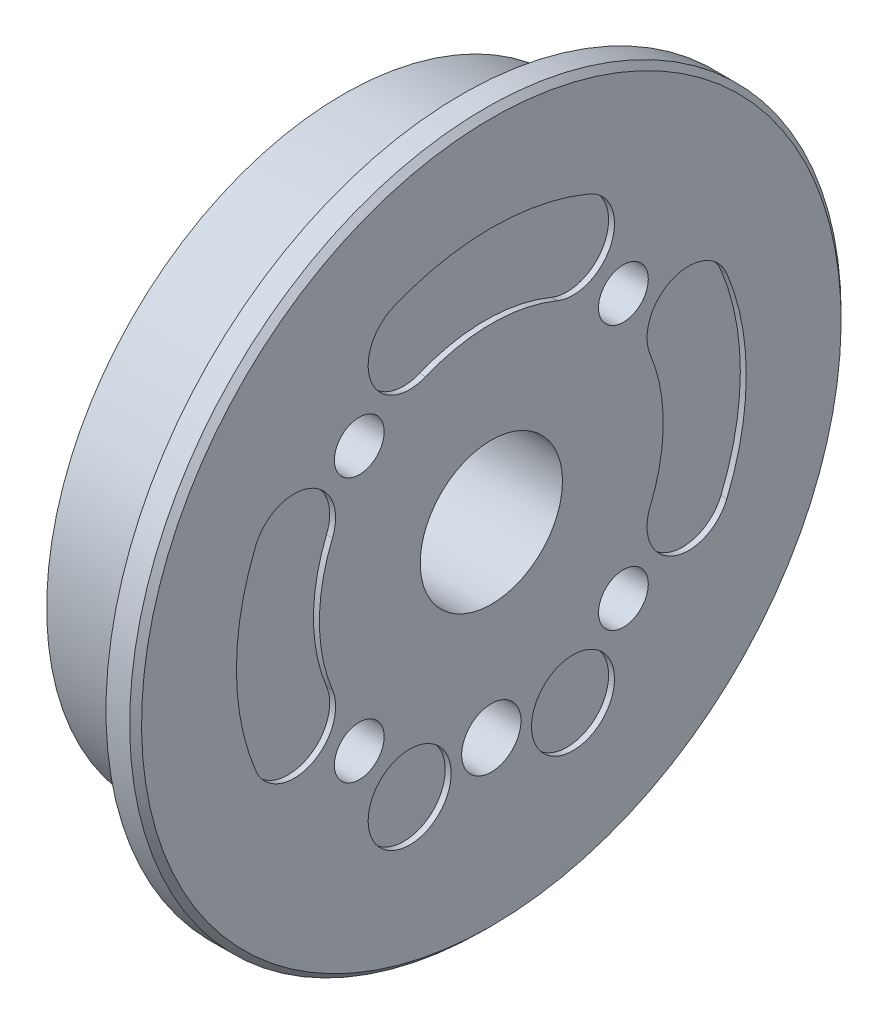
ISO-10303-21;
HEADER;
FILE_DESCRIPTION(('STEP AP214'),'2;1');
FILE_NAME('part.step','',(''),(''),'','','');
FILE_SCHEMA(('AUTOMOTIVE_DESIGN { 1 0 10303 214 1 1 1 1 }'));
ENDSEC;
DATA;
#1=APPLICATION_CONTEXT('core data for automotive mechanical design processes');
#2=APPLICATION_PROTOCOL_DEFINITION('international standard','automotive_design',2000,#1);
#3=PRODUCT_CONTEXT('',#1,'mechanical');
#4=PRODUCT('Part','Part','',(#3));
#5=PRODUCT_RELATED_PRODUCT_CATEGORY('part','',(#4));
#6=PRODUCT_DEFINITION_FORMATION('','',#4);
#7=PRODUCT_DEFINITION_CONTEXT('part definition',#1,'design');
#8=PRODUCT_DEFINITION('design','',#6,#7);
#9=PRODUCT_DEFINITION_SHAPE('','',#8);
#10=(LENGTH_UNIT() NAMED_UNIT(*) SI_UNIT(.MILLI.,.METRE.));
#11=(NAMED_UNIT(*) PLANE_ANGLE_UNIT() SI_UNIT($,.RADIAN.));
#12=(NAMED_UNIT(*) SI_UNIT($,.STERADIAN.) SOLID_ANGLE_UNIT());
#13=UNCERTAINTY_MEASURE_WITH_UNIT(LENGTH_MEASURE(1.E-05),#10,'distance_accuracy_value','');
#14=(GEOMETRIC_REPRESENTATION_CONTEXT(3) GLOBAL_UNCERTAINTY_ASSIGNED_CONTEXT((#13)) GLOBAL_UNIT_ASSIGNED_CONTEXT((#10,
#11,#12)) REPRESENTATION_CONTEXT('',''));
#15=CARTESIAN_POINT('',(0.,0.,0.));
#16=DIRECTION('',(0.,0.,1.));
#17=DIRECTION('',(1.,0.,0.));
#18=AXIS2_PLACEMENT_3D('',#15,#16,#17);
#19=CARTESIAN_POINT('',(0.,0.,0.));
#20=DIRECTION('',(1.,0.,0.));
#21=DIRECTION('',(0.,0.,-1.));
#22=AXIS2_PLACEMENT_3D('',#19,#20,#21);
#23=PLANE('',#22);
#24=CARTESIAN_POINT('',(0.,11.13693180369,-11.13693180369));
#25=DIRECTION('',(1.,0.,0.));
#26=DIRECTION('',(0.,0.,-1.));
#27=AXIS2_PLACEMENT_3D('',#24,#25,#26);
#28=CIRCLE('',#27,2.1);
#29=CARTESIAN_POINT('',(0.,11.13693180369,-13.23693180369));
#30=VERTEX_POINT('',#29);
#31=EDGE_CURVE('E224',#30,#30,#28,.T.);
#32=ORIENTED_EDGE('',*,*,#31,.T.);
#33=EDGE_LOOP('',(#32));
#34=FACE_BOUND('',#33,.T.);
#35=CARTESIAN_POINT('',(0.,0.,0.));
#36=DIRECTION('',(1.,0.,0.));
#37=DIRECTION('',(0.,0.,-1.));
#38=AXIS2_PLACEMENT_3D('',#35,#36,#37);
#39=CIRCLE('',#38,6.);
#40=CARTESIAN_POINT('',(0.,0.,-6.));
#41=VERTEX_POINT('',#40);
#42=EDGE_CURVE('E227',#41,#41,#39,.T.);
#43=ORIENTED_EDGE('',*,*,#42,.T.);
#44=EDGE_LOOP('',(#43));
#45=FACE_BOUND('',#44,.T.);
#46=CARTESIAN_POINT('',(0.,-11.13693180369,-11.13693180369));
#47=DIRECTION('',(1.,0.,0.));
#48=DIRECTION('',(0.,0.,-1.));
#49=AXIS2_PLACEMENT_3D('',#46,#47,#48);
#50=CIRCLE('',#49,2.1);
#51=CARTESIAN_POINT('',(0.,-11.13693180369,-13.23693180369));
#52=VERTEX_POINT('',#51);
#53=EDGE_CURVE('E231',#52,#52,#50,.T.);
#54=ORIENTED_EDGE('',*,*,#53,.T.);
#55=EDGE_LOOP('',(#54));
#56=FACE_BOUND('',#55,.T.);
#57=CARTESIAN_POINT('',(0.,-11.13693180369,11.13693180369));
#58=DIRECTION('',(1.,0.,0.));
#59=DIRECTION('',(0.,0.,-1.));
#60=AXIS2_PLACEMENT_3D('',#57,#58,#59);
#61=CIRCLE('',#60,2.1);
#62=CARTESIAN_POINT('',(0.,-11.13693180369,9.03693180369));
#63=VERTEX_POINT('',#62);
#64=EDGE_CURVE('E152',#63,#63,#61,.T.);
#65=ORIENTED_EDGE('',*,*,#64,.T.);
#66=EDGE_LOOP('',(#65));
#67=FACE_BOUND('',#66,.T.);
#68=CARTESIAN_POINT('',(0.,0.,0.));
#69=DIRECTION('',(1.,0.,0.));
#70=DIRECTION('',(0.,0.,-1.));
#71=AXIS2_PLACEMENT_3D('',#68,#69,#70);
#72=CIRCLE('',#71,25.);
#73=CARTESIAN_POINT('',(0.,0.,-25.));
#74=VERTEX_POINT('',#73);
#75=EDGE_CURVE('E156',#74,#74,#72,.F.);
#76=ORIENTED_EDGE('',*,*,#75,.T.);
#77=EDGE_LOOP('',(#76));
#78=FACE_BOUND('',#77,.T.);
#79=CARTESIAN_POINT('',(0.,11.13693180369,11.13693180369));
#80=DIRECTION('',(1.,0.,0.));
#81=DIRECTION('',(0.,0.,-1.));
#82=AXIS2_PLACEMENT_3D('',#79,#80,#81);
#83=CIRCLE('',#82,2.1);
#84=CARTESIAN_POINT('',(0.,11.13693180369,9.03693180369));
#85=VERTEX_POINT('',#84);
#86=EDGE_CURVE('E11',#85,#85,#83,.T.);
#87=ORIENTED_EDGE('',*,*,#86,.T.);
#88=EDGE_LOOP('',(#87));
#89=FACE_BOUND('',#88,.T.);
#90=ADVANCED_FACE('F16',(#34,#45,#56,#67,#78,#89),#23,.F.);
#91=CARTESIAN_POINT('',(10.,0.,0.));
#92=DIRECTION('',(1.,0.,0.));
#93=DIRECTION('',(0.,0.,-1.));
#94=AXIS2_PLACEMENT_3D('',#91,#92,#93);
#95=PLANE('',#94);
#96=CARTESIAN_POINT('',(10.,0.,0.));
#97=DIRECTION('',(1.,0.,0.));
#98=DIRECTION('',(0.,0.,-1.));
#99=AXIS2_PLACEMENT_3D('',#96,#97,#98);
#100=CIRCLE('',#99,30.);
#101=CARTESIAN_POINT('',(10.,0.,-30.));
#102=VERTEX_POINT('',#101);
#103=EDGE_CURVE('E219',#102,#102,#100,.T.);
#104=ORIENTED_EDGE('',*,*,#103,.F.);
#105=EDGE_LOOP('',(#104));
#106=FACE_BOUND('',#105,.T.);
#107=CARTESIAN_POINT('',(10.,0.,0.));
#108=DIRECTION('',(1.,0.,0.));
#109=DIRECTION('',(0.,0.,-1.));
#110=AXIS2_PLACEMENT_3D('',#107,#108,#109);
#111=CIRCLE('',#110,25.);
#112=CARTESIAN_POINT('',(10.,0.,-25.));
#113=VERTEX_POINT('',#112);
#114=EDGE_CURVE('E24',#113,#113,#111,.T.);
#115=ORIENTED_EDGE('',*,*,#114,.T.);
#116=EDGE_LOOP('',(#115));
#117=FACE_BOUND('',#116,.T.);
#118=ADVANCED_FACE('F257',(#106,#117),#95,.F.);
#119=CARTESIAN_POINT('',(-0.625,0.,0.));
#120=DIRECTION('',(1.,0.,0.));
#121=DIRECTION('',(0.,0.,-1.));
#122=AXIS2_PLACEMENT_3D('',#119,#120,#121);
#123=CYLINDRICAL_SURFACE('',#122,30.);
#124=CARTESIAN_POINT('',(12.,0.,0.));
#125=DIRECTION('',(-1.,0.,0.));
#126=DIRECTION('',(0.,0.,-1.));
#127=AXIS2_PLACEMENT_3D('',#124,#125,#126);
#128=CIRCLE('',#127,30.);
#129=CARTESIAN_POINT('',(12.,0.,-30.));
#130=VERTEX_POINT('',#129);
#131=EDGE_CURVE('E149',#130,#130,#128,.F.);
#132=ORIENTED_EDGE('',*,*,#131,.F.);
#133=EDGE_LOOP('',(#132));
#134=FACE_BOUND('',#133,.T.);
#135=ORIENTED_EDGE('',*,*,#103,.T.);
#136=EDGE_LOOP('',(#135));
#137=FACE_BOUND('',#136,.T.);
#138=ADVANCED_FACE('F263',(#134,#137),#123,.T.);
#139=CARTESIAN_POINT('',(-0.625,0.,0.));
#140=DIRECTION('',(1.,0.,0.));
#141=DIRECTION('',(0.,0.,-1.));
#142=AXIS2_PLACEMENT_3D('',#139,#140,#141);
#143=CYLINDRICAL_SURFACE('',#142,25.);
#144=ORIENTED_EDGE('',*,*,#75,.F.);
#145=EDGE_LOOP('',(#144));
#146=FACE_BOUND('',#145,.T.);
#147=ORIENTED_EDGE('',*,*,#114,.F.);
#148=EDGE_LOOP('',(#147));
#149=FACE_BOUND('',#148,.T.);
#150=ADVANCED_FACE('F268',(#146,#149),#143,.T.);
#151=CARTESIAN_POINT('',(5.5,0.,0.));
#152=DIRECTION('',(1.,0.,0.));
#153=DIRECTION('',(0.,0.,-1.));
#154=AXIS2_PLACEMENT_3D('',#151,#152,#153);
#155=PLANE('',#154);
#156=CARTESIAN_POINT('',(5.5,-15.75,0.));
#157=DIRECTION('',(1.,0.,0.));
#158=DIRECTION('',(0.,0.,-1.));
#159=AXIS2_PLACEMENT_3D('',#156,#157,#158);
#160=CIRCLE('',#159,2.5);
#161=CARTESIAN_POINT('',(5.5,-15.75,-2.5));
#162=VERTEX_POINT('',#161);
#163=EDGE_CURVE('E148',#162,#162,#160,.T.);
#164=ORIENTED_EDGE('',*,*,#163,.T.);
#165=EDGE_LOOP('',(#164));
#166=FACE_BOUND('',#165,.T.);
#167=ADVANCED_FACE('F276',(#166),#155,.T.);
#168=CARTESIAN_POINT('',(12.,0.,0.));
#169=DIRECTION('',(-1.,0.,0.));
#170=DIRECTION('',(0.,-1.,0.));
#171=AXIS2_PLACEMENT_3D('',#168,#169,#170);
#172=CONICAL_SURFACE('',#171,30.,0.785398163397301);
#173=CARTESIAN_POINT('',(12.5,0.,0.));
#174=DIRECTION('',(-1.,0.,0.));
#175=DIRECTION('',(0.,-1.,0.));
#176=AXIS2_PLACEMENT_3D('',#173,#174,#175);
#177=CIRCLE('',#176,29.5);
#178=CARTESIAN_POINT('',(12.5,-29.5,0.));
#179=VERTEX_POINT('',#178);
#180=EDGE_CURVE('E211',#179,#179,#177,.F.);
#181=ORIENTED_EDGE('',*,*,#180,.F.);
#182=EDGE_LOOP('',(#181));
#183=FACE_BOUND('',#182,.T.);
#184=ORIENTED_EDGE('',*,*,#131,.T.);
#185=EDGE_LOOP('',(#184));
#186=FACE_BOUND('',#185,.T.);
#187=ADVANCED_FACE('F286',(#183,#186),#172,.T.);
#188=CARTESIAN_POINT('',(12.5,-15.75,0.));
#189=DIRECTION('',(1.,0.,0.));
#190=DIRECTION('',(0.,0.,-1.));
#191=AXIS2_PLACEMENT_3D('',#188,#189,#190);
#192=CYLINDRICAL_SURFACE('',#191,2.5);
#193=ORIENTED_EDGE('',*,*,#163,.F.);
#194=EDGE_LOOP('',(#193));
#195=FACE_BOUND('',#194,.T.);
#196=CARTESIAN_POINT('',(12.5,-15.75,0.));
#197=DIRECTION('',(1.,0.,0.));
#198=DIRECTION('',(0.,0.,-1.));
#199=AXIS2_PLACEMENT_3D('',#196,#197,#198);
#200=CIRCLE('',#199,2.5);
#201=CARTESIAN_POINT('',(12.5,-15.75,-2.5));
#202=VERTEX_POINT('',#201);
#203=EDGE_CURVE('E208',#202,#202,#200,.F.);
#204=ORIENTED_EDGE('',*,*,#203,.F.);
#205=EDGE_LOOP('',(#204));
#206=FACE_BOUND('',#205,.T.);
#207=ADVANCED_FACE('F288',(#195,#206),#192,.F.);
#208=CARTESIAN_POINT('',(-0.8998976649558,-11.13693180369,-11.13693180369));
#209=DIRECTION('',(1.,0.,0.));
#210=DIRECTION('',(0.,0.,-1.));
#211=AXIS2_PLACEMENT_3D('',#208,#209,#210);
#212=CYLINDRICAL_SURFACE('',#211,2.1);
#213=CARTESIAN_POINT('',(12.5,-11.13693180369,-11.13693180369));
#214=DIRECTION('',(1.,0.,0.));
#215=DIRECTION('',(0.,0.,-1.));
#216=AXIS2_PLACEMENT_3D('',#213,#214,#215);
#217=CIRCLE('',#216,2.1);
#218=CARTESIAN_POINT('',(12.5,-11.13693180369,-13.23693180369));
#219=VERTEX_POINT('',#218);
#220=EDGE_CURVE('E205',#219,#219,#217,.F.);
#221=ORIENTED_EDGE('',*,*,#220,.F.);
#222=EDGE_LOOP('',(#221));
#223=FACE_BOUND('',#222,.T.);
#224=ORIENTED_EDGE('',*,*,#53,.F.);
#225=EDGE_LOOP('',(#224));
#226=FACE_BOUND('',#225,.T.);
#227=ADVANCED_FACE('F295',(#223,#226),#212,.F.);
#228=CARTESIAN_POINT('',(-0.8998976649558,11.13693180369,-11.13693180369));
#229=DIRECTION('',(1.,0.,0.));
#230=DIRECTION('',(0.,0.,-1.));
#231=AXIS2_PLACEMENT_3D('',#228,#229,#230);
#232=CYLINDRICAL_SURFACE('',#231,2.1);
#233=CARTESIAN_POINT('',(12.5,11.13693180369,-11.13693180369));
#234=DIRECTION('',(1.,0.,0.));
#235=DIRECTION('',(0.,0.,-1.));
#236=AXIS2_PLACEMENT_3D('',#233,#234,#235);
#237=CIRCLE('',#236,2.1);
#238=CARTESIAN_POINT('',(12.5,11.13693180369,-13.23693180369));
#239=VERTEX_POINT('',#238);
#240=EDGE_CURVE('E202',#239,#239,#237,.F.);
#241=ORIENTED_EDGE('',*,*,#240,.F.);
#242=EDGE_LOOP('',(#241));
#243=FACE_BOUND('',#242,.T.);
#244=ORIENTED_EDGE('',*,*,#31,.F.);
#245=EDGE_LOOP('',(#244));
#246=FACE_BOUND('',#245,.T.);
#247=ADVANCED_FACE('F18',(#243,#246),#232,.F.);
#248=CARTESIAN_POINT('',(-0.8998976649558,11.13693180369,11.13693180369));
#249=DIRECTION('',(1.,0.,0.));
#250=DIRECTION('',(0.,0.,-1.));
#251=AXIS2_PLACEMENT_3D('',#248,#249,#250);
#252=CYLINDRICAL_SURFACE('',#251,2.1);
#253=CARTESIAN_POINT('',(12.5,11.13693180369,11.13693180369));
#254=DIRECTION('',(1.,0.,0.));
#255=DIRECTION('',(0.,0.,-1.));
#256=AXIS2_PLACEMENT_3D('',#253,#254,#255);
#257=CIRCLE('',#256,2.1);
#258=CARTESIAN_POINT('',(12.5,11.13693180369,9.03693180369));
#259=VERTEX_POINT('',#258);
#260=EDGE_CURVE('E199',#259,#259,#257,.F.);
#261=ORIENTED_EDGE('',*,*,#260,.F.);
#262=EDGE_LOOP('',(#261));
#263=FACE_BOUND('',#262,.T.);
#264=ORIENTED_EDGE('',*,*,#86,.F.);
#265=EDGE_LOOP('',(#264));
#266=FACE_BOUND('',#265,.T.);
#267=ADVANCED_FACE('F241',(#263,#266),#252,.F.);
#268=CARTESIAN_POINT('',(-0.8998976649558,-11.13693180369,11.13693180369));
#269=DIRECTION('',(1.,0.,0.));
#270=DIRECTION('',(0.,0.,-1.));
#271=AXIS2_PLACEMENT_3D('',#268,#269,#270);
#272=CYLINDRICAL_SURFACE('',#271,2.1);
#273=CARTESIAN_POINT('',(12.5,-11.13693180369,11.13693180369));
#274=DIRECTION('',(1.,0.,0.));
#275=DIRECTION('',(0.,0.,-1.));
#276=AXIS2_PLACEMENT_3D('',#273,#274,#275);
#277=CIRCLE('',#276,2.1);
#278=CARTESIAN_POINT('',(12.5,-11.13693180369,9.03693180369));
#279=VERTEX_POINT('',#278);
#280=EDGE_CURVE('E196',#279,#279,#277,.F.);
#281=ORIENTED_EDGE('',*,*,#280,.F.);
#282=EDGE_LOOP('',(#281));
#283=FACE_BOUND('',#282,.T.);
#284=ORIENTED_EDGE('',*,*,#64,.F.);
#285=EDGE_LOOP('',(#284));
#286=FACE_BOUND('',#285,.T.);
#287=ADVANCED_FACE('F238',(#283,#286),#272,.F.);
#288=CARTESIAN_POINT('',(12.5,-16.6298315852,6.888301782572));
#289=DIRECTION('',(-1.,0.,0.));
#290=DIRECTION('',(0.,0.,1.));
#291=AXIS2_PLACEMENT_3D('',#288,#289,#290);
#292=CYLINDRICAL_SURFACE('',#291,3.5);
#293=CARTESIAN_POINT('',(12.,-16.6298315852,6.888301782572));
#294=DIRECTION('',(1.,0.,0.));
#295=DIRECTION('',(0.,0.,-1.));
#296=AXIS2_PLACEMENT_3D('',#293,#294,#295);
#297=CIRCLE('',#296,3.5);
#298=CARTESIAN_POINT('',(12.,-16.6298315852,3.388301782572));
#299=VERTEX_POINT('',#298);
#300=EDGE_CURVE('E611',#299,#299,#297,.T.);
#301=ORIENTED_EDGE('',*,*,#300,.F.);
#302=EDGE_LOOP('',(#301));
#303=FACE_BOUND('',#302,.T.);
#304=CARTESIAN_POINT('',(12.5,-16.6298315852,6.888301782572));
#305=DIRECTION('',(-1.,0.,0.));
#306=DIRECTION('',(0.,0.,1.));
#307=AXIS2_PLACEMENT_3D('',#304,#305,#306);
#308=CIRCLE('',#307,3.5);
#309=CARTESIAN_POINT('',(12.5,-16.6298315852,10.388301782572));
#310=VERTEX_POINT('',#309);
#311=EDGE_CURVE('E193',#310,#310,#308,.T.);
#312=ORIENTED_EDGE('',*,*,#311,.F.);
#313=EDGE_LOOP('',(#312));
#314=FACE_BOUND('',#313,.T.);
#315=ADVANCED_FACE('F240',(#303,#314),#292,.F.);
#316=CARTESIAN_POINT('',(12.5,-16.6298315852,-6.888301782572));
#317=DIRECTION('',(-1.,0.,0.));
#318=DIRECTION('',(0.,0.,1.));
#319=AXIS2_PLACEMENT_3D('',#316,#317,#318);
#320=CYLINDRICAL_SURFACE('',#319,3.5);
#321=CARTESIAN_POINT('',(12.,-16.6298315852,-6.888301782572));
#322=DIRECTION('',(1.,0.,0.));
#323=DIRECTION('',(0.,0.,-1.));
#324=AXIS2_PLACEMENT_3D('',#321,#322,#323);
#325=CIRCLE('',#324,3.5);
#326=CARTESIAN_POINT('',(12.,-16.6298315852,-10.388301782572));
#327=VERTEX_POINT('',#326);
#328=EDGE_CURVE('E608',#327,#327,#325,.T.);
#329=ORIENTED_EDGE('',*,*,#328,.F.);
#330=EDGE_LOOP('',(#329));
#331=FACE_BOUND('',#330,.T.);
#332=CARTESIAN_POINT('',(12.5,-16.6298315852,-6.888301782572));
#333=DIRECTION('',(-1.,0.,0.));
#334=DIRECTION('',(0.,0.,1.));
#335=AXIS2_PLACEMENT_3D('',#332,#333,#334);
#336=CIRCLE('',#335,3.5);
#337=CARTESIAN_POINT('',(12.5,-16.6298315852,-3.388301782572));
#338=VERTEX_POINT('',#337);
#339=EDGE_CURVE('E190',#338,#338,#336,.T.);
#340=ORIENTED_EDGE('',*,*,#339,.F.);
#341=EDGE_LOOP('',(#340));
#342=FACE_BOUND('',#341,.T.);
#343=ADVANCED_FACE('F249',(#331,#342),#320,.F.);
#344=CARTESIAN_POINT('',(12.5,16.6298315852,-6.888301782572));
#345=DIRECTION('',(-1.,0.,0.));
#346=DIRECTION('',(0.,0.,1.));
#347=AXIS2_PLACEMENT_3D('',#344,#345,#346);
#348=CYLINDRICAL_SURFACE('',#347,3.5);
#349=DIRECTION('',(1.,0.,0.));
#350=VECTOR('',#349,1.);
#351=CARTESIAN_POINT('',(12.5,19.8634099489924,-8.22769379585001));
#352=LINE('',#351,#350);
#353=CARTESIAN_POINT('',(12.5,19.8634099489909,-8.22769379585005));
#354=VERTEX_POINT('',#353);
#355=CARTESIAN_POINT('',(12.,19.8634099489924,-8.22769379585001));
#356=VERTEX_POINT('',#355);
#357=EDGE_CURVE('E140',#354,#356,#352,.F.);
#358=ORIENTED_EDGE('',*,*,#357,.T.);
#359=CARTESIAN_POINT('',(12.,16.6298315852,-6.888301782572));
#360=DIRECTION('',(1.,0.,0.));
#361=DIRECTION('',(0.,0.,-1.));
#362=AXIS2_PLACEMENT_3D('',#359,#360,#361);
#363=CIRCLE('',#362,3.5);
#364=CARTESIAN_POINT('',(12.,13.3962532214112,-5.54890976929432));
#365=VERTEX_POINT('',#364);
#366=EDGE_CURVE('E39',#365,#356,#363,.T.);
#367=ORIENTED_EDGE('',*,*,#366,.F.);
#368=DIRECTION('',(1.,0.,0.));
#369=VECTOR('',#368,1.);
#370=CARTESIAN_POINT('',(12.5,13.396253221413,-5.54890976929527));
#371=LINE('',#370,#369);
#372=CARTESIAN_POINT('',(12.5,13.3962532214131,-5.54890976929512));
#373=VERTEX_POINT('',#372);
#374=EDGE_CURVE('E145',#373,#365,#371,.F.);
#375=ORIENTED_EDGE('',*,*,#374,.F.);
#376=CARTESIAN_POINT('',(12.5,16.6298315852,-6.888301782572));
#377=DIRECTION('',(-1.,0.,0.));
#378=DIRECTION('',(0.,0.,1.));
#379=AXIS2_PLACEMENT_3D('',#376,#377,#378);
#380=CIRCLE('',#379,3.5);
#381=EDGE_CURVE('E187',#354,#373,#380,.T.);
#382=ORIENTED_EDGE('',*,*,#381,.F.);
#383=EDGE_LOOP('',(#358,#367,#375,#382));
#384=FACE_BOUND('',#383,.T.);
#385=ADVANCED_FACE('F304',(#384),#348,.F.);
#386=CARTESIAN_POINT('',(12.5,0.,0.));
#387=DIRECTION('',(1.,0.,0.));
#388=DIRECTION('',(0.,0.,-1.));
#389=AXIS2_PLACEMENT_3D('',#386,#387,#388);
#390=CYLINDRICAL_SURFACE('',#389,14.5);
#391=CARTESIAN_POINT('',(12.,0.,0.));
#392=DIRECTION('',(-1.,0.,0.));
#393=DIRECTION('',(0.,0.,-1.));
#394=AXIS2_PLACEMENT_3D('',#391,#392,#393);
#395=CIRCLE('',#394,14.4999999999979);
#396=CARTESIAN_POINT('',(12.,13.3962532214093,5.54890976929352));
#397=VERTEX_POINT('',#396);
#398=EDGE_CURVE('E607',#397,#365,#395,.T.);
#399=ORIENTED_EDGE('',*,*,#398,.F.);
#400=DIRECTION('',(-1.,0.,0.));
#401=VECTOR('',#400,1.);
#402=CARTESIAN_POINT('',(12.5,13.3962532214105,5.5489097692942));
#403=LINE('',#402,#401);
#404=CARTESIAN_POINT('',(12.5,13.3962532214105,5.54890976929405));
#405=VERTEX_POINT('',#404);
#406=EDGE_CURVE('E143',#397,#405,#403,.F.);
#407=ORIENTED_EDGE('',*,*,#406,.T.);
#408=CARTESIAN_POINT('',(12.5,0.,0.));
#409=DIRECTION('',(1.,0.,0.));
#410=DIRECTION('',(0.,0.,-1.));
#411=AXIS2_PLACEMENT_3D('',#408,#409,#410);
#412=CIRCLE('',#411,14.5);
#413=EDGE_CURVE('E184',#373,#405,#412,.T.);
#414=ORIENTED_EDGE('',*,*,#413,.F.);
#415=ORIENTED_EDGE('',*,*,#374,.T.);
#416=EDGE_LOOP('',(#399,#407,#414,#415));
#417=FACE_BOUND('',#416,.T.);
#418=ADVANCED_FACE('F308',(#417),#390,.T.);
#419=CARTESIAN_POINT('',(12.5,16.6298315852,6.888301782572));
#420=DIRECTION('',(-1.,0.,0.));
#421=DIRECTION('',(0.,0.,1.));
#422=AXIS2_PLACEMENT_3D('',#419,#420,#421);
#423=CYLINDRICAL_SURFACE('',#422,3.5);
#424=ORIENTED_EDGE('',*,*,#406,.F.);
#425=CARTESIAN_POINT('',(12.,16.6298315852,6.888301782572));
#426=DIRECTION('',(1.,0.,0.));
#427=DIRECTION('',(0.,0.,-1.));
#428=AXIS2_PLACEMENT_3D('',#425,#426,#427);
#429=CIRCLE('',#428,3.50000000000139);
#430=CARTESIAN_POINT('',(12.,19.8634099489915,8.22769379585032));
#431=VERTEX_POINT('',#430);
#432=EDGE_CURVE('E603',#431,#397,#429,.T.);
#433=ORIENTED_EDGE('',*,*,#432,.F.);
#434=DIRECTION('',(1.,0.,0.));
#435=VECTOR('',#434,1.);
#436=CARTESIAN_POINT('',(12.5,19.8634099489924,8.22769379585001));
#437=LINE('',#436,#435);
#438=CARTESIAN_POINT('',(12.5,19.8634099489922,8.22769379585058));
#439=VERTEX_POINT('',#438);
#440=EDGE_CURVE('E138',#431,#439,#437,.T.);
#441=ORIENTED_EDGE('',*,*,#440,.T.);
#442=CARTESIAN_POINT('',(12.5,16.6298315852,6.888301782572));
#443=DIRECTION('',(-1.,0.,0.));
#444=DIRECTION('',(0.,0.,1.));
#445=AXIS2_PLACEMENT_3D('',#442,#443,#444);
#446=CIRCLE('',#445,3.5);
#447=EDGE_CURVE('E181',#405,#439,#446,.T.);
#448=ORIENTED_EDGE('',*,*,#447,.F.);
#449=EDGE_LOOP('',(#424,#433,#441,#448));
#450=FACE_BOUND('',#449,.T.);
#451=ADVANCED_FACE('F312',(#450),#423,.F.);
#452=CARTESIAN_POINT('',(12.5,0.,0.));
#453=DIRECTION('',(1.,0.,0.));
#454=DIRECTION('',(0.,0.,-1.));
#455=AXIS2_PLACEMENT_3D('',#452,#453,#454);
#456=CYLINDRICAL_SURFACE('',#455,21.5);
#457=ORIENTED_EDGE('',*,*,#440,.F.);
#458=CARTESIAN_POINT('',(12.,0.,0.));
#459=DIRECTION('',(1.,0.,0.));
#460=DIRECTION('',(0.,0.,-1.));
#461=AXIS2_PLACEMENT_3D('',#458,#459,#460);
#462=CIRCLE('',#461,21.4999999999993);
#463=EDGE_CURVE('E605',#356,#431,#462,.T.);
#464=ORIENTED_EDGE('',*,*,#463,.F.);
#465=ORIENTED_EDGE('',*,*,#357,.F.);
#466=CARTESIAN_POINT('',(12.5,0.,0.));
#467=DIRECTION('',(1.,0.,0.));
#468=DIRECTION('',(0.,0.,-1.));
#469=AXIS2_PLACEMENT_3D('',#466,#467,#468);
#470=CIRCLE('',#469,21.5);
#471=EDGE_CURVE('E178',#439,#354,#470,.F.);
#472=ORIENTED_EDGE('',*,*,#471,.F.);
#473=EDGE_LOOP('',(#457,#464,#465,#472));
#474=FACE_BOUND('',#473,.T.);
#475=ADVANCED_FACE('F316',(#474),#456,.F.);
#476=CARTESIAN_POINT('',(12.5,6.888301782572,16.6298315852));
#477=DIRECTION('',(-1.,0.,0.));
#478=DIRECTION('',(0.,0.,1.));
#479=AXIS2_PLACEMENT_3D('',#476,#477,#478);
#480=CYLINDRICAL_SURFACE('',#479,3.5);
#481=DIRECTION('',(1.,0.,0.));
#482=VECTOR('',#481,1.);
#483=CARTESIAN_POINT('',(12.5,8.22769379585001,19.8634099489924));
#484=LINE('',#483,#482);
#485=CARTESIAN_POINT('',(12.5,8.22769379585005,19.8634099489909));
#486=VERTEX_POINT('',#485);
#487=CARTESIAN_POINT('',(12.,8.22769379585001,19.8634099489924));
#488=VERTEX_POINT('',#487);
#489=EDGE_CURVE('E126',#486,#488,#484,.F.);
#490=ORIENTED_EDGE('',*,*,#489,.T.);
#491=CARTESIAN_POINT('',(12.,6.888301782572,16.6298315852));
#492=DIRECTION('',(1.,0.,0.));
#493=DIRECTION('',(0.,0.,-1.));
#494=AXIS2_PLACEMENT_3D('',#491,#492,#493);
#495=CIRCLE('',#494,3.5);
#496=CARTESIAN_POINT('',(12.,5.54890976929432,13.3962532214112));
#497=VERTEX_POINT('',#496);
#498=EDGE_CURVE('E31',#497,#488,#495,.T.);
#499=ORIENTED_EDGE('',*,*,#498,.F.);
#500=DIRECTION('',(1.,0.,0.));
#501=VECTOR('',#500,1.);
#502=CARTESIAN_POINT('',(12.5,5.54890976929527,13.396253221413));
#503=LINE('',#502,#501);
#504=CARTESIAN_POINT('',(12.5,5.54890976929512,13.3962532214131));
#505=VERTEX_POINT('',#504);
#506=EDGE_CURVE('E135',#505,#497,#503,.F.);
#507=ORIENTED_EDGE('',*,*,#506,.F.);
#508=CARTESIAN_POINT('',(12.5,6.888301782572,16.6298315852));
#509=DIRECTION('',(-1.,0.,0.));
#510=DIRECTION('',(0.,0.,1.));
#511=AXIS2_PLACEMENT_3D('',#508,#509,#510);
#512=CIRCLE('',#511,3.5);
#513=EDGE_CURVE('E175',#486,#505,#512,.T.);
#514=ORIENTED_EDGE('',*,*,#513,.F.);
#515=EDGE_LOOP('',(#490,#499,#507,#514));
#516=FACE_BOUND('',#515,.T.);
#517=ADVANCED_FACE('F320',(#516),#480,.F.);
#518=CARTESIAN_POINT('',(12.5,0.,0.));
#519=DIRECTION('',(1.,0.,0.));
#520=DIRECTION('',(0.,0.,-1.));
#521=AXIS2_PLACEMENT_3D('',#518,#519,#520);
#522=CYLINDRICAL_SURFACE('',#521,14.5);
#523=CARTESIAN_POINT('',(12.,0.,0.));
#524=DIRECTION('',(-1.,0.,0.));
#525=DIRECTION('',(0.,0.,-1.));
#526=AXIS2_PLACEMENT_3D('',#523,#524,#525);
#527=CIRCLE('',#526,14.4999999999979);
#528=CARTESIAN_POINT('',(12.,-5.54890976929432,13.3962532214112));
#529=VERTEX_POINT('',#528);
#530=EDGE_CURVE('E119',#529,#497,#527,.T.);
#531=ORIENTED_EDGE('',*,*,#530,.F.);
#532=DIRECTION('',(-1.,0.,0.));
#533=VECTOR('',#532,1.);
#534=CARTESIAN_POINT('',(12.5,-5.5489097692942,13.3962532214105));
#535=LINE('',#534,#533);
#536=CARTESIAN_POINT('',(12.5,-5.54890976929405,13.3962532214105));
#537=VERTEX_POINT('',#536);
#538=EDGE_CURVE('E118',#529,#537,#535,.F.);
#539=ORIENTED_EDGE('',*,*,#538,.T.);
#540=CARTESIAN_POINT('',(12.5,0.,0.));
#541=DIRECTION('',(1.,0.,0.));
#542=DIRECTION('',(0.,0.,-1.));
#543=AXIS2_PLACEMENT_3D('',#540,#541,#542);
#544=CIRCLE('',#543,14.5);
#545=EDGE_CURVE('E172',#505,#537,#544,.T.);
#546=ORIENTED_EDGE('',*,*,#545,.F.);
#547=ORIENTED_EDGE('',*,*,#506,.T.);
#548=EDGE_LOOP('',(#531,#539,#546,#547));
#549=FACE_BOUND('',#548,.T.);
#550=ADVANCED_FACE('F324',(#549),#522,.T.);
#551=CARTESIAN_POINT('',(12.5,-6.888301782572,16.6298315852));
#552=DIRECTION('',(-1.,0.,0.));
#553=DIRECTION('',(0.,0.,1.));
#554=AXIS2_PLACEMENT_3D('',#551,#552,#553);
#555=CYLINDRICAL_SURFACE('',#554,3.5);
#556=ORIENTED_EDGE('',*,*,#538,.F.);
#557=CARTESIAN_POINT('',(12.,-6.888301782572,16.6298315852));
#558=DIRECTION('',(1.,0.,0.));
#559=DIRECTION('',(0.,0.,-1.));
#560=AXIS2_PLACEMENT_3D('',#557,#558,#559);
#561=CIRCLE('',#560,3.50000000000139);
#562=CARTESIAN_POINT('',(12.,-8.22769379585005,19.8634099489909));
#563=VERTEX_POINT('',#562);
#564=EDGE_CURVE('E105',#563,#529,#561,.T.);
#565=ORIENTED_EDGE('',*,*,#564,.F.);
#566=DIRECTION('',(1.,0.,0.));
#567=VECTOR('',#566,1.);
#568=CARTESIAN_POINT('',(12.5,-8.22769379585,19.8634099489924));
#569=LINE('',#568,#567);
#570=CARTESIAN_POINT('',(12.5,-8.22769379585058,19.8634099489922));
#571=VERTEX_POINT('',#570);
#572=EDGE_CURVE('E116',#563,#571,#569,.T.);
#573=ORIENTED_EDGE('',*,*,#572,.T.);
#574=CARTESIAN_POINT('',(12.5,-6.888301782572,16.6298315852));
#575=DIRECTION('',(-1.,0.,0.));
#576=DIRECTION('',(0.,0.,1.));
#577=AXIS2_PLACEMENT_3D('',#574,#575,#576);
#578=CIRCLE('',#577,3.5);
#579=EDGE_CURVE('E170',#537,#571,#578,.T.);
#580=ORIENTED_EDGE('',*,*,#579,.F.);
#581=EDGE_LOOP('',(#556,#565,#573,#580));
#582=FACE_BOUND('',#581,.T.);
#583=ADVANCED_FACE('F114',(#582),#555,.F.);
#584=CARTESIAN_POINT('',(12.5,0.,0.));
#585=DIRECTION('',(1.,0.,0.));
#586=DIRECTION('',(0.,0.,-1.));
#587=AXIS2_PLACEMENT_3D('',#584,#585,#586);
#588=CYLINDRICAL_SURFACE('',#587,21.5);
#589=ORIENTED_EDGE('',*,*,#572,.F.);
#590=CARTESIAN_POINT('',(12.,0.,0.));
#591=DIRECTION('',(1.,0.,0.));
#592=DIRECTION('',(0.,0.,-1.));
#593=AXIS2_PLACEMENT_3D('',#590,#591,#592);
#594=CIRCLE('',#593,21.4999999999993);
#595=EDGE_CURVE('E102',#488,#563,#594,.T.);
#596=ORIENTED_EDGE('',*,*,#595,.F.);
#597=ORIENTED_EDGE('',*,*,#489,.F.);
#598=CARTESIAN_POINT('',(12.5,0.,0.));
#599=DIRECTION('',(1.,0.,0.));
#600=DIRECTION('',(0.,0.,-1.));
#601=AXIS2_PLACEMENT_3D('',#598,#599,#600);
#602=CIRCLE('',#601,21.5);
#603=EDGE_CURVE('E123',#571,#486,#602,.F.);
#604=ORIENTED_EDGE('',*,*,#603,.F.);
#605=EDGE_LOOP('',(#589,#596,#597,#604));
#606=FACE_BOUND('',#605,.T.);
#607=ADVANCED_FACE('F121',(#606),#588,.F.);
#608=CARTESIAN_POINT('',(12.5,-6.888301782572,-16.6298315852));
#609=DIRECTION('',(-1.,0.,0.));
#610=DIRECTION('',(0.,0.,1.));
#611=AXIS2_PLACEMENT_3D('',#608,#609,#610);
#612=CYLINDRICAL_SURFACE('',#611,3.5);
#613=DIRECTION('',(1.,0.,0.));
#614=VECTOR('',#613,1.);
#615=CARTESIAN_POINT('',(12.5,-8.22769379585001,-19.8634099489924));
#616=LINE('',#615,#614);
#617=CARTESIAN_POINT('',(12.5,-8.22769379585005,-19.8634099489909));
#618=VERTEX_POINT('',#617);
#619=CARTESIAN_POINT('',(12.,-8.22769379585001,-19.8634099489924));
#620=VERTEX_POINT('',#619);
#621=EDGE_CURVE('E626',#618,#620,#616,.F.);
#622=ORIENTED_EDGE('',*,*,#621,.T.);
#623=CARTESIAN_POINT('',(12.,-6.888301782572,-16.6298315852));
#624=DIRECTION('',(1.,0.,0.));
#625=DIRECTION('',(0.,0.,-1.));
#626=AXIS2_PLACEMENT_3D('',#623,#624,#625);
#627=CIRCLE('',#626,3.5);
#628=CARTESIAN_POINT('',(12.,-5.54890976929432,-13.3962532214112));
#629=VERTEX_POINT('',#628);
#630=EDGE_CURVE('E618',#629,#620,#627,.T.);
#631=ORIENTED_EDGE('',*,*,#630,.F.);
#632=DIRECTION('',(1.,0.,0.));
#633=VECTOR('',#632,1.);
#634=CARTESIAN_POINT('',(12.5,-5.54890976929526,-13.396253221413));
#635=LINE('',#634,#633);
#636=CARTESIAN_POINT('',(12.5,-5.54890976929512,-13.3962532214131));
#637=VERTEX_POINT('',#636);
#638=EDGE_CURVE('E125',#637,#629,#635,.F.);
#639=ORIENTED_EDGE('',*,*,#638,.F.);
#640=CARTESIAN_POINT('',(12.5,-6.888301782572,-16.6298315852));
#641=DIRECTION('',(-1.,0.,0.));
#642=DIRECTION('',(0.,0.,1.));
#643=AXIS2_PLACEMENT_3D('',#640,#641,#642);
#644=CIRCLE('',#643,3.5);
#645=EDGE_CURVE('E166',#618,#637,#644,.T.);
#646=ORIENTED_EDGE('',*,*,#645,.F.);
#647=EDGE_LOOP('',(#622,#631,#639,#646));
#648=FACE_BOUND('',#647,.T.);
#649=ADVANCED_FACE('F333',(#648),#612,.F.);
#650=CARTESIAN_POINT('',(12.5,0.,0.));
#651=DIRECTION('',(1.,0.,0.));
#652=DIRECTION('',(0.,0.,-1.));
#653=AXIS2_PLACEMENT_3D('',#650,#651,#652);
#654=CYLINDRICAL_SURFACE('',#653,14.5);
#655=CARTESIAN_POINT('',(12.,0.,0.));
#656=DIRECTION('',(-1.,0.,0.));
#657=DIRECTION('',(0.,0.,-1.));
#658=AXIS2_PLACEMENT_3D('',#655,#656,#657);
#659=CIRCLE('',#658,14.4999999999979);
#660=CARTESIAN_POINT('',(12.,5.54890976929432,-13.3962532214112));
#661=VERTEX_POINT('',#660);
#662=EDGE_CURVE('E228',#661,#629,#659,.T.);
#663=ORIENTED_EDGE('',*,*,#662,.F.);
#664=DIRECTION('',(-1.,0.,0.));
#665=VECTOR('',#664,1.);
#666=CARTESIAN_POINT('',(12.5,5.5489097692942,-13.3962532214105));
#667=LINE('',#666,#665);
#668=CARTESIAN_POINT('',(12.5,5.54890976929405,-13.3962532214105));
#669=VERTEX_POINT('',#668);
#670=EDGE_CURVE('E129',#661,#669,#667,.F.);
#671=ORIENTED_EDGE('',*,*,#670,.T.);
#672=CARTESIAN_POINT('',(12.5,0.,0.));
#673=DIRECTION('',(1.,0.,0.));
#674=DIRECTION('',(0.,0.,-1.));
#675=AXIS2_PLACEMENT_3D('',#672,#673,#674);
#676=CIRCLE('',#675,14.5);
#677=EDGE_CURVE('E163',#637,#669,#676,.T.);
#678=ORIENTED_EDGE('',*,*,#677,.F.);
#679=ORIENTED_EDGE('',*,*,#638,.T.);
#680=EDGE_LOOP('',(#663,#671,#678,#679));
#681=FACE_BOUND('',#680,.T.);
#682=ADVANCED_FACE('F336',(#681),#654,.T.);
#683=CARTESIAN_POINT('',(12.5,6.888301782572,-16.6298315852));
#684=DIRECTION('',(-1.,0.,0.));
#685=DIRECTION('',(0.,0.,1.));
#686=AXIS2_PLACEMENT_3D('',#683,#684,#685);
#687=CYLINDRICAL_SURFACE('',#686,3.5);
#688=ORIENTED_EDGE('',*,*,#670,.F.);
#689=CARTESIAN_POINT('',(12.,6.888301782572,-16.6298315852));
#690=DIRECTION('',(1.,0.,0.));
#691=DIRECTION('',(0.,0.,-1.));
#692=AXIS2_PLACEMENT_3D('',#689,#690,#691);
#693=CIRCLE('',#692,3.50000000000139);
#694=CARTESIAN_POINT('',(12.,8.22769379585005,-19.8634099489909));
#695=VERTEX_POINT('',#694);
#696=EDGE_CURVE('E622',#695,#661,#693,.T.);
#697=ORIENTED_EDGE('',*,*,#696,.F.);
#698=DIRECTION('',(1.,0.,0.));
#699=VECTOR('',#698,1.);
#700=CARTESIAN_POINT('',(12.5,8.22769379585001,-19.8634099489924));
#701=LINE('',#700,#699);
#702=CARTESIAN_POINT('',(12.5,8.22769379585058,-19.8634099489922));
#703=VERTEX_POINT('',#702);
#704=EDGE_CURVE('E214',#695,#703,#701,.T.);
#705=ORIENTED_EDGE('',*,*,#704,.T.);
#706=CARTESIAN_POINT('',(12.5,6.888301782572,-16.6298315852));
#707=DIRECTION('',(-1.,0.,0.));
#708=DIRECTION('',(0.,0.,1.));
#709=AXIS2_PLACEMENT_3D('',#706,#707,#708);
#710=CIRCLE('',#709,3.5);
#711=EDGE_CURVE('E160',#669,#703,#710,.T.);
#712=ORIENTED_EDGE('',*,*,#711,.F.);
#713=EDGE_LOOP('',(#688,#697,#705,#712));
#714=FACE_BOUND('',#713,.T.);
#715=ADVANCED_FACE('F340',(#714),#687,.F.);
#716=CARTESIAN_POINT('',(12.5,0.,0.));
#717=DIRECTION('',(1.,0.,0.));
#718=DIRECTION('',(0.,0.,-1.));
#719=AXIS2_PLACEMENT_3D('',#716,#717,#718);
#720=CYLINDRICAL_SURFACE('',#719,21.5);
#721=ORIENTED_EDGE('',*,*,#704,.F.);
#722=CARTESIAN_POINT('',(12.,0.,0.));
#723=DIRECTION('',(1.,0.,0.));
#724=DIRECTION('',(0.,0.,-1.));
#725=AXIS2_PLACEMENT_3D('',#722,#723,#724);
#726=CIRCLE('',#725,21.4999999999993);
#727=EDGE_CURVE('E620',#620,#695,#726,.T.);
#728=ORIENTED_EDGE('',*,*,#727,.F.);
#729=ORIENTED_EDGE('',*,*,#621,.F.);
#730=CARTESIAN_POINT('',(12.5,0.,0.));
#731=DIRECTION('',(1.,0.,0.));
#732=DIRECTION('',(0.,0.,-1.));
#733=AXIS2_PLACEMENT_3D('',#730,#731,#732);
#734=CIRCLE('',#733,21.5);
#735=EDGE_CURVE('E157',#703,#618,#734,.F.);
#736=ORIENTED_EDGE('',*,*,#735,.F.);
#737=EDGE_LOOP('',(#721,#728,#729,#736));
#738=FACE_BOUND('',#737,.T.);
#739=ADVANCED_FACE('F344',(#738),#720,.F.);
#740=CARTESIAN_POINT('',(-0.625,0.,0.));
#741=DIRECTION('',(1.,0.,0.));
#742=DIRECTION('',(0.,0.,-1.));
#743=AXIS2_PLACEMENT_3D('',#740,#741,#742);
#744=CYLINDRICAL_SURFACE('',#743,6.);
#745=CARTESIAN_POINT('',(12.5,0.,0.));
#746=DIRECTION('',(1.,0.,0.));
#747=DIRECTION('',(0.,0.,-1.));
#748=AXIS2_PLACEMENT_3D('',#745,#746,#747);
#749=CIRCLE('',#748,6.);
#750=CARTESIAN_POINT('',(12.5,0.,-6.));
#751=VERTEX_POINT('',#750);
#752=EDGE_CURVE('E153',#751,#751,#749,.F.);
#753=ORIENTED_EDGE('',*,*,#752,.F.);
#754=EDGE_LOOP('',(#753));
#755=FACE_BOUND('',#754,.T.);
#756=ORIENTED_EDGE('',*,*,#42,.F.);
#757=EDGE_LOOP('',(#756));
#758=FACE_BOUND('',#757,.T.);
#759=ADVANCED_FACE('F348',(#755,#758),#744,.F.);
#760=CARTESIAN_POINT('',(12.5,0.,0.));
#761=DIRECTION('',(1.,0.,0.));
#762=DIRECTION('',(0.,0.,-1.));
#763=AXIS2_PLACEMENT_3D('',#760,#761,#762);
#764=PLANE('',#763);
#765=ORIENTED_EDGE('',*,*,#752,.T.);
#766=EDGE_LOOP('',(#765));
#767=FACE_BOUND('',#766,.T.);
#768=ORIENTED_EDGE('',*,*,#711,.T.);
#769=ORIENTED_EDGE('',*,*,#735,.T.);
#770=ORIENTED_EDGE('',*,*,#645,.T.);
#771=ORIENTED_EDGE('',*,*,#677,.T.);
#772=EDGE_LOOP('',(#768,#769,#770,#771));
#773=FACE_BOUND('',#772,.T.);
#774=ORIENTED_EDGE('',*,*,#579,.T.);
#775=ORIENTED_EDGE('',*,*,#603,.T.);
#776=ORIENTED_EDGE('',*,*,#513,.T.);
#777=ORIENTED_EDGE('',*,*,#545,.T.);
#778=EDGE_LOOP('',(#774,#775,#776,#777));
#779=FACE_BOUND('',#778,.T.);
#780=ORIENTED_EDGE('',*,*,#447,.T.);
#781=ORIENTED_EDGE('',*,*,#471,.T.);
#782=ORIENTED_EDGE('',*,*,#381,.T.);
#783=ORIENTED_EDGE('',*,*,#413,.T.);
#784=EDGE_LOOP('',(#780,#781,#782,#783));
#785=FACE_BOUND('',#784,.T.);
#786=ORIENTED_EDGE('',*,*,#339,.T.);
#787=EDGE_LOOP('',(#786));
#788=FACE_BOUND('',#787,.T.);
#789=ORIENTED_EDGE('',*,*,#311,.T.);
#790=EDGE_LOOP('',(#789));
#791=FACE_BOUND('',#790,.T.);
#792=ORIENTED_EDGE('',*,*,#280,.T.);
#793=EDGE_LOOP('',(#792));
#794=FACE_BOUND('',#793,.T.);
#795=ORIENTED_EDGE('',*,*,#260,.T.);
#796=EDGE_LOOP('',(#795));
#797=FACE_BOUND('',#796,.T.);
#798=ORIENTED_EDGE('',*,*,#240,.T.);
#799=EDGE_LOOP('',(#798));
#800=FACE_BOUND('',#799,.T.);
#801=ORIENTED_EDGE('',*,*,#220,.T.);
#802=EDGE_LOOP('',(#801));
#803=FACE_BOUND('',#802,.T.);
#804=ORIENTED_EDGE('',*,*,#203,.T.);
#805=EDGE_LOOP('',(#804));
#806=FACE_BOUND('',#805,.T.);
#807=ORIENTED_EDGE('',*,*,#180,.T.);
#808=EDGE_LOOP('',(#807));
#809=FACE_BOUND('',#808,.T.);
#810=ADVANCED_FACE('F278',(#767,#773,#779,#785,#788,#791,#794,#797,#800,#803,#806,#809),#764,.T.);
#811=CARTESIAN_POINT('',(12.,-3.444150891286,-8.3149157926));
#812=DIRECTION('',(1.,0.,0.));
#813=DIRECTION('',(0.,0.,-1.));
#814=AXIS2_PLACEMENT_3D('',#811,#812,#813);
#815=PLANE('',#814);
#816=ORIENTED_EDGE('',*,*,#630,.T.);
#817=ORIENTED_EDGE('',*,*,#727,.T.);
#818=ORIENTED_EDGE('',*,*,#696,.T.);
#819=ORIENTED_EDGE('',*,*,#662,.T.);
#820=EDGE_LOOP('',(#816,#817,#818,#819));
#821=FACE_BOUND('',#820,.T.);
#822=ADVANCED_FACE('F299',(#821),#815,.T.);
#823=CARTESIAN_POINT('',(12.,-16.6298315852,6.888301782572));
#824=DIRECTION('',(1.,0.,0.));
#825=DIRECTION('',(0.,0.,-1.));
#826=AXIS2_PLACEMENT_3D('',#823,#824,#825);
#827=PLANE('',#826);
#828=ORIENTED_EDGE('',*,*,#300,.T.);
#829=EDGE_LOOP('',(#828));
#830=FACE_BOUND('',#829,.T.);
#831=ADVANCED_FACE('F355',(#830),#827,.T.);
#832=CARTESIAN_POINT('',(12.,-16.6298315852,-6.888301782572));
#833=DIRECTION('',(1.,0.,0.));
#834=DIRECTION('',(0.,0.,-1.));
#835=AXIS2_PLACEMENT_3D('',#832,#833,#834);
#836=PLANE('',#835);
#837=ORIENTED_EDGE('',*,*,#328,.T.);
#838=EDGE_LOOP('',(#837));
#839=FACE_BOUND('',#838,.T.);
#840=ADVANCED_FACE('F359',(#839),#836,.T.);
#841=CARTESIAN_POINT('',(12.,8.3149157926,-3.444150891286));
#842=DIRECTION('',(1.,0.,0.));
#843=DIRECTION('',(0.,0.,-1.));
#844=AXIS2_PLACEMENT_3D('',#841,#842,#843);
#845=PLANE('',#844);
#846=ORIENTED_EDGE('',*,*,#366,.T.);
#847=ORIENTED_EDGE('',*,*,#463,.T.);
#848=ORIENTED_EDGE('',*,*,#432,.T.);
#849=ORIENTED_EDGE('',*,*,#398,.T.);
#850=EDGE_LOOP('',(#846,#847,#848,#849));
#851=FACE_BOUND('',#850,.T.);
#852=ADVANCED_FACE('F363',(#851),#845,.T.);
#853=CARTESIAN_POINT('',(12.,3.444150891286,8.3149157926));
#854=DIRECTION('',(1.,0.,0.));
#855=DIRECTION('',(0.,0.,-1.));
#856=AXIS2_PLACEMENT_3D('',#853,#854,#855);
#857=PLANE('',#856);
#858=ORIENTED_EDGE('',*,*,#498,.T.);
#859=ORIENTED_EDGE('',*,*,#595,.T.);
#860=ORIENTED_EDGE('',*,*,#564,.T.);
#861=ORIENTED_EDGE('',*,*,#530,.T.);
#862=EDGE_LOOP('',(#858,#859,#860,#861));
#863=FACE_BOUND('',#862,.T.);
#864=ADVANCED_FACE('F104',(#863),#857,.T.);
#865=CLOSED_SHELL('',(#90,#118,#138,#150,#167,#187,#207,#227,#247,#267,#287,#315,#343,#385,#418,
#451,#475,#517,#550,#583,#607,#649,#682,#715,#739,#759,#810,#822,#831,#840,#852,#864));
#866=MANIFOLD_SOLID_BREP('B1',#865);
#867=ADVANCED_BREP_SHAPE_REPRESENTATION('',(#18,#866),#14);
#868=SHAPE_DEFINITION_REPRESENTATION(#9,#867);
ENDSEC;
END-ISO-10303-21;
